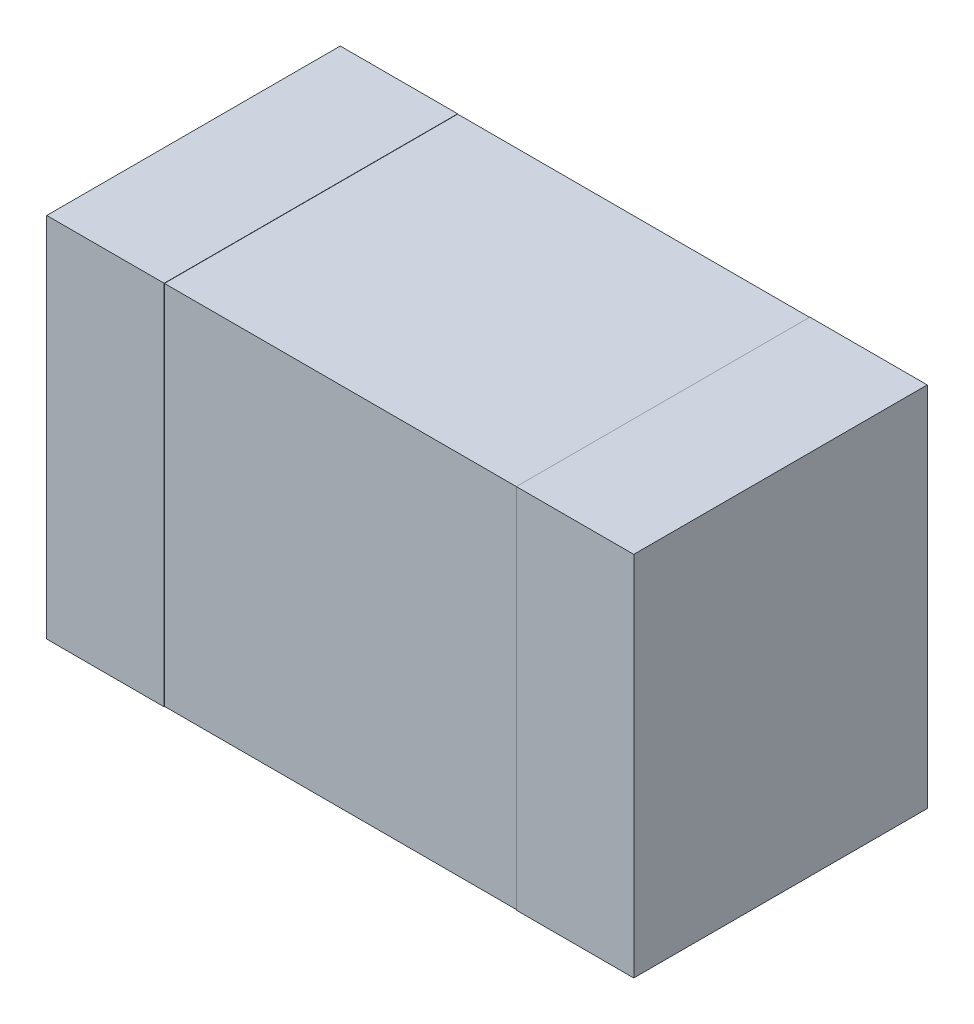
ISO-10303-21;
HEADER;
FILE_DESCRIPTION(('STEP AP214'),'2;1');
FILE_NAME('part.step','',(''),(''),'','','');
FILE_SCHEMA(('AUTOMOTIVE_DESIGN { 1 0 10303 214 1 1 1 1 }'));
ENDSEC;
DATA;
#1=APPLICATION_CONTEXT('core data for automotive mechanical design processes');
#2=APPLICATION_PROTOCOL_DEFINITION('international standard','automotive_design',2000,#1);
#3=PRODUCT_CONTEXT('',#1,'mechanical');
#4=PRODUCT('Part','Part','',(#3));
#5=PRODUCT_RELATED_PRODUCT_CATEGORY('part','',(#4));
#6=PRODUCT_DEFINITION_FORMATION('','',#4);
#7=PRODUCT_DEFINITION_CONTEXT('part definition',#1,'design');
#8=PRODUCT_DEFINITION('design','',#6,#7);
#9=PRODUCT_DEFINITION_SHAPE('','',#8);
#10=(LENGTH_UNIT() NAMED_UNIT(*) SI_UNIT(.MILLI.,.METRE.));
#11=(NAMED_UNIT(*) PLANE_ANGLE_UNIT() SI_UNIT($,.RADIAN.));
#12=(NAMED_UNIT(*) SI_UNIT($,.STERADIAN.) SOLID_ANGLE_UNIT());
#13=UNCERTAINTY_MEASURE_WITH_UNIT(LENGTH_MEASURE(1.E-05),#10,'distance_accuracy_value','');
#14=(GEOMETRIC_REPRESENTATION_CONTEXT(3) GLOBAL_UNCERTAINTY_ASSIGNED_CONTEXT((#13)) GLOBAL_UNIT_ASSIGNED_CONTEXT((#10,
#11,#12)) REPRESENTATION_CONTEXT('',''));
#15=CARTESIAN_POINT('',(0.,0.,0.));
#16=DIRECTION('',(0.,0.,1.));
#17=DIRECTION('',(1.,0.,0.));
#18=AXIS2_PLACEMENT_3D('',#15,#16,#17);
#19=CARTESIAN_POINT('',(0.,0.,1.));
#20=DIRECTION('',(0.,0.,1.));
#21=DIRECTION('',(1.,0.,0.));
#22=AXIS2_PLACEMENT_3D('',#19,#20,#21);
#23=PLANE('',#22);
#24=DIRECTION('',(0.,1.,0.));
#25=VECTOR('',#24,1.);
#26=CARTESIAN_POINT('',(1.,0.625,1.));
#27=LINE('',#26,#25);
#28=CARTESIAN_POINT('',(1.,-0.625,1.));
#29=VERTEX_POINT('',#28);
#30=CARTESIAN_POINT('',(1.,0.625,1.));
#31=VERTEX_POINT('',#30);
#32=EDGE_CURVE('E223',#29,#31,#27,.T.);
#33=ORIENTED_EDGE('',*,*,#32,.T.);
#34=DIRECTION('',(1.,0.,0.));
#35=VECTOR('',#34,1.);
#36=CARTESIAN_POINT('',(-1.,0.625,1.));
#37=LINE('',#36,#35);
#38=CARTESIAN_POINT('',(0.6,0.625,1.));
#39=VERTEX_POINT('',#38);
#40=EDGE_CURVE('E217',#31,#39,#37,.F.);
#41=ORIENTED_EDGE('',*,*,#40,.T.);
#42=DIRECTION('',(0.,1.,0.));
#43=VECTOR('',#42,1.);
#44=CARTESIAN_POINT('',(0.6,0.625,1.));
#45=LINE('',#44,#43);
#46=CARTESIAN_POINT('',(0.6,-0.625,1.));
#47=VERTEX_POINT('',#46);
#48=EDGE_CURVE('E211',#39,#47,#45,.F.);
#49=ORIENTED_EDGE('',*,*,#48,.T.);
#50=DIRECTION('',(1.,0.,0.));
#51=VECTOR('',#50,1.);
#52=CARTESIAN_POINT('',(-1.,-0.625,1.));
#53=LINE('',#52,#51);
#54=EDGE_CURVE('E93',#47,#29,#53,.T.);
#55=ORIENTED_EDGE('',*,*,#54,.T.);
#56=EDGE_LOOP('',(#33,#41,#49,#55));
#57=FACE_BOUND('',#56,.T.);
#58=ADVANCED_FACE('F16',(#57),#23,.T.);
#59=CARTESIAN_POINT('',(0.,0.,1.));
#60=DIRECTION('',(0.,0.,1.));
#61=DIRECTION('',(1.,0.,0.));
#62=AXIS2_PLACEMENT_3D('',#59,#60,#61);
#63=PLANE('',#62);
#64=DIRECTION('',(1.,0.,0.));
#65=VECTOR('',#64,1.);
#66=CARTESIAN_POINT('',(-1.,0.625,1.));
#67=LINE('',#66,#65);
#68=CARTESIAN_POINT('',(-0.6,0.625,1.));
#69=VERTEX_POINT('',#68);
#70=CARTESIAN_POINT('',(-1.,0.625,1.));
#71=VERTEX_POINT('',#70);
#72=EDGE_CURVE('E107',#69,#71,#67,.F.);
#73=ORIENTED_EDGE('',*,*,#72,.T.);
#74=DIRECTION('',(0.,1.,0.));
#75=VECTOR('',#74,1.);
#76=CARTESIAN_POINT('',(-1.,0.625,1.));
#77=LINE('',#76,#75);
#78=CARTESIAN_POINT('',(-1.,-0.625,1.));
#79=VERTEX_POINT('',#78);
#80=EDGE_CURVE('E136',#71,#79,#77,.F.);
#81=ORIENTED_EDGE('',*,*,#80,.T.);
#82=DIRECTION('',(1.,0.,0.));
#83=VECTOR('',#82,1.);
#84=CARTESIAN_POINT('',(-1.,-0.625,1.));
#85=LINE('',#84,#83);
#86=CARTESIAN_POINT('',(-0.6,-0.625,1.));
#87=VERTEX_POINT('',#86);
#88=EDGE_CURVE('E119',#79,#87,#85,.T.);
#89=ORIENTED_EDGE('',*,*,#88,.T.);
#90=DIRECTION('',(0.,1.,0.));
#91=VECTOR('',#90,1.);
#92=CARTESIAN_POINT('',(-0.6,0.625,1.));
#93=LINE('',#92,#91);
#94=EDGE_CURVE('E184',#87,#69,#93,.T.);
#95=ORIENTED_EDGE('',*,*,#94,.T.);
#96=EDGE_LOOP('',(#73,#81,#89,#95));
#97=FACE_BOUND('',#96,.T.);
#98=ADVANCED_FACE('F288',(#97),#63,.T.);
#99=CARTESIAN_POINT('',(0.6,-0.625,0.999));
#100=DIRECTION('',(0.,0.,-1.));
#101=DIRECTION('',(-1.,0.,0.));
#102=AXIS2_PLACEMENT_3D('',#99,#100,#101);
#103=PLANE('',#102);
#104=DIRECTION('',(1.,0.,0.));
#105=VECTOR('',#104,1.);
#106=CARTESIAN_POINT('',(0.6,0.624,0.999));
#107=LINE('',#106,#105);
#108=CARTESIAN_POINT('',(0.6,0.624,0.999));
#109=VERTEX_POINT('',#108);
#110=CARTESIAN_POINT('',(-0.6,0.624,0.999));
#111=VERTEX_POINT('',#110);
#112=EDGE_CURVE('E114',#109,#111,#107,.F.);
#113=ORIENTED_EDGE('',*,*,#112,.T.);
#114=DIRECTION('',(0.,1.,0.));
#115=VECTOR('',#114,1.);
#116=CARTESIAN_POINT('',(-0.6,0.625,0.999));
#117=LINE('',#116,#115);
#118=CARTESIAN_POINT('',(-0.6,-0.624,0.999));
#119=VERTEX_POINT('',#118);
#120=EDGE_CURVE('E190',#111,#119,#117,.F.);
#121=ORIENTED_EDGE('',*,*,#120,.T.);
#122=DIRECTION('',(1.,0.,0.));
#123=VECTOR('',#122,1.);
#124=CARTESIAN_POINT('',(0.6,-0.624,0.999));
#125=LINE('',#124,#123);
#126=CARTESIAN_POINT('',(0.6,-0.624,0.999));
#127=VERTEX_POINT('',#126);
#128=EDGE_CURVE('E176',#119,#127,#125,.T.);
#129=ORIENTED_EDGE('',*,*,#128,.T.);
#130=DIRECTION('',(0.,1.,0.));
#131=VECTOR('',#130,1.);
#132=CARTESIAN_POINT('',(0.6,0.625,0.999));
#133=LINE('',#132,#131);
#134=EDGE_CURVE('E68',#127,#109,#133,.T.);
#135=ORIENTED_EDGE('',*,*,#134,.T.);
#136=EDGE_LOOP('',(#113,#121,#129,#135));
#137=FACE_BOUND('',#136,.T.);
#138=ADVANCED_FACE('F293',(#137),#103,.F.);
#139=CARTESIAN_POINT('',(-1.,-0.625,1.));
#140=DIRECTION('',(0.,1.,0.));
#141=DIRECTION('',(0.,0.,1.));
#142=AXIS2_PLACEMENT_3D('',#139,#140,#141);
#143=PLANE('',#142);
#144=DIRECTION('',(0.,0.,-1.));
#145=VECTOR('',#144,1.);
#146=CARTESIAN_POINT('',(0.6,-0.625,1.));
#147=LINE('',#146,#145);
#148=CARTESIAN_POINT('',(0.6,-0.625,0.));
#149=VERTEX_POINT('',#148);
#150=EDGE_CURVE('E209',#47,#149,#147,.T.);
#151=ORIENTED_EDGE('',*,*,#150,.T.);
#152=DIRECTION('',(1.,0.,0.));
#153=VECTOR('',#152,1.);
#154=CARTESIAN_POINT('',(0.,-0.625,0.));
#155=LINE('',#154,#153);
#156=CARTESIAN_POINT('',(1.,-0.625,0.));
#157=VERTEX_POINT('',#156);
#158=EDGE_CURVE('E170',#149,#157,#155,.T.);
#159=ORIENTED_EDGE('',*,*,#158,.T.);
#160=DIRECTION('',(0.,0.,1.));
#161=VECTOR('',#160,1.);
#162=CARTESIAN_POINT('',(1.,-0.625,1.));
#163=LINE('',#162,#161);
#164=EDGE_CURVE('E230',#157,#29,#163,.T.);
#165=ORIENTED_EDGE('',*,*,#164,.T.);
#166=ORIENTED_EDGE('',*,*,#54,.F.);
#167=EDGE_LOOP('',(#151,#159,#165,#166));
#168=FACE_BOUND('',#167,.T.);
#169=ADVANCED_FACE('F285',(#168),#143,.F.);
#170=CARTESIAN_POINT('',(1.,0.625,1.));
#171=DIRECTION('',(-1.,0.,0.));
#172=DIRECTION('',(0.,0.,1.));
#173=AXIS2_PLACEMENT_3D('',#170,#171,#172);
#174=PLANE('',#173);
#175=DIRECTION('',(0.,0.,-1.));
#176=VECTOR('',#175,1.);
#177=CARTESIAN_POINT('',(1.,0.625,1.));
#178=LINE('',#177,#176);
#179=CARTESIAN_POINT('',(1.,0.625,0.));
#180=VERTEX_POINT('',#179);
#181=EDGE_CURVE('E220',#180,#31,#178,.F.);
#182=ORIENTED_EDGE('',*,*,#181,.T.);
#183=ORIENTED_EDGE('',*,*,#32,.F.);
#184=ORIENTED_EDGE('',*,*,#164,.F.);
#185=DIRECTION('',(0.,1.,0.));
#186=VECTOR('',#185,1.);
#187=CARTESIAN_POINT('',(1.,0.,0.));
#188=LINE('',#187,#186);
#189=EDGE_CURVE('E167',#157,#180,#188,.T.);
#190=ORIENTED_EDGE('',*,*,#189,.T.);
#191=EDGE_LOOP('',(#182,#183,#184,#190));
#192=FACE_BOUND('',#191,.T.);
#193=ADVANCED_FACE('F284',(#192),#174,.F.);
#194=CARTESIAN_POINT('',(-1.,0.625,1.));
#195=DIRECTION('',(0.,-1.,0.));
#196=DIRECTION('',(0.,0.,-1.));
#197=AXIS2_PLACEMENT_3D('',#194,#195,#196);
#198=PLANE('',#197);
#199=DIRECTION('',(0.,0.,-1.));
#200=VECTOR('',#199,1.);
#201=CARTESIAN_POINT('',(0.6,0.625,1.));
#202=LINE('',#201,#200);
#203=CARTESIAN_POINT('',(0.6,0.625,0.));
#204=VERTEX_POINT('',#203);
#205=EDGE_CURVE('E214',#204,#39,#202,.F.);
#206=ORIENTED_EDGE('',*,*,#205,.T.);
#207=ORIENTED_EDGE('',*,*,#40,.F.);
#208=ORIENTED_EDGE('',*,*,#181,.F.);
#209=DIRECTION('',(1.,0.,0.));
#210=VECTOR('',#209,1.);
#211=CARTESIAN_POINT('',(0.,0.625,0.));
#212=LINE('',#211,#210);
#213=EDGE_CURVE('E164',#180,#204,#212,.F.);
#214=ORIENTED_EDGE('',*,*,#213,.T.);
#215=EDGE_LOOP('',(#206,#207,#208,#214));
#216=FACE_BOUND('',#215,.T.);
#217=ADVANCED_FACE('F280',(#216),#198,.F.);
#218=CARTESIAN_POINT('',(0.6,0.625,1.));
#219=DIRECTION('',(1.,0.,0.));
#220=DIRECTION('',(0.,0.,-1.));
#221=AXIS2_PLACEMENT_3D('',#218,#219,#220);
#222=PLANE('',#221);
#223=DIRECTION('',(0.,0.,-1.));
#224=VECTOR('',#223,1.);
#225=CARTESIAN_POINT('',(0.6,0.624,1.));
#226=LINE('',#225,#224);
#227=CARTESIAN_POINT('',(0.6,0.624,0.));
#228=VERTEX_POINT('',#227);
#229=EDGE_CURVE('E205',#228,#109,#226,.F.);
#230=ORIENTED_EDGE('',*,*,#229,.T.);
#231=ORIENTED_EDGE('',*,*,#134,.F.);
#232=DIRECTION('',(0.,0.,1.));
#233=VECTOR('',#232,1.);
#234=CARTESIAN_POINT('',(0.6,-0.624,1.));
#235=LINE('',#234,#233);
#236=CARTESIAN_POINT('',(0.6,-0.624,0.));
#237=VERTEX_POINT('',#236);
#238=EDGE_CURVE('E179',#127,#237,#235,.F.);
#239=ORIENTED_EDGE('',*,*,#238,.T.);
#240=DIRECTION('',(0.,1.,0.));
#241=VECTOR('',#240,1.);
#242=CARTESIAN_POINT('',(0.6,0.625,0.));
#243=LINE('',#242,#241);
#244=EDGE_CURVE('E19',#237,#149,#243,.F.);
#245=ORIENTED_EDGE('',*,*,#244,.T.);
#246=ORIENTED_EDGE('',*,*,#150,.F.);
#247=ORIENTED_EDGE('',*,*,#48,.F.);
#248=ORIENTED_EDGE('',*,*,#205,.F.);
#249=DIRECTION('',(0.,1.,0.));
#250=VECTOR('',#249,1.);
#251=CARTESIAN_POINT('',(0.6,0.625,0.));
#252=LINE('',#251,#250);
#253=EDGE_CURVE('E163',#204,#228,#252,.F.);
#254=ORIENTED_EDGE('',*,*,#253,.T.);
#255=EDGE_LOOP('',(#230,#231,#239,#245,#246,#247,#248,#254));
#256=FACE_BOUND('',#255,.T.);
#257=ADVANCED_FACE('F274',(#256),#222,.F.);
#258=CARTESIAN_POINT('',(0.6,0.624,1.));
#259=DIRECTION('',(0.,-1.,0.));
#260=DIRECTION('',(0.,0.,-1.));
#261=AXIS2_PLACEMENT_3D('',#258,#259,#260);
#262=PLANE('',#261);
#263=ORIENTED_EDGE('',*,*,#112,.F.);
#264=ORIENTED_EDGE('',*,*,#229,.F.);
#265=DIRECTION('',(1.,0.,0.));
#266=VECTOR('',#265,1.);
#267=CARTESIAN_POINT('',(0.,0.624,0.));
#268=LINE('',#267,#266);
#269=CARTESIAN_POINT('',(-0.6,0.624,0.));
#270=VERTEX_POINT('',#269);
#271=EDGE_CURVE('E153',#228,#270,#268,.F.);
#272=ORIENTED_EDGE('',*,*,#271,.T.);
#273=DIRECTION('',(0.,0.,1.));
#274=VECTOR('',#273,1.);
#275=CARTESIAN_POINT('',(-0.6,0.624,1.));
#276=LINE('',#275,#274);
#277=EDGE_CURVE('E193',#270,#111,#276,.T.);
#278=ORIENTED_EDGE('',*,*,#277,.T.);
#279=EDGE_LOOP('',(#263,#264,#272,#278));
#280=FACE_BOUND('',#279,.T.);
#281=ADVANCED_FACE('F313',(#280),#262,.F.);
#282=CARTESIAN_POINT('',(-1.,0.625,1.));
#283=DIRECTION('',(0.,-1.,0.));
#284=DIRECTION('',(0.,0.,-1.));
#285=AXIS2_PLACEMENT_3D('',#282,#283,#284);
#286=PLANE('',#285);
#287=DIRECTION('',(0.,0.,1.));
#288=VECTOR('',#287,1.);
#289=CARTESIAN_POINT('',(-0.6,0.625,1.));
#290=LINE('',#289,#288);
#291=CARTESIAN_POINT('',(-0.6,0.625,0.));
#292=VERTEX_POINT('',#291);
#293=EDGE_CURVE('E150',#69,#292,#290,.F.);
#294=ORIENTED_EDGE('',*,*,#293,.T.);
#295=DIRECTION('',(1.,0.,0.));
#296=VECTOR('',#295,1.);
#297=CARTESIAN_POINT('',(0.,0.625,0.));
#298=LINE('',#297,#296);
#299=CARTESIAN_POINT('',(-1.,0.625,0.));
#300=VERTEX_POINT('',#299);
#301=EDGE_CURVE('E144',#292,#300,#298,.F.);
#302=ORIENTED_EDGE('',*,*,#301,.T.);
#303=DIRECTION('',(0.,0.,-1.));
#304=VECTOR('',#303,1.);
#305=CARTESIAN_POINT('',(-1.,0.625,1.));
#306=LINE('',#305,#304);
#307=EDGE_CURVE('E132',#300,#71,#306,.F.);
#308=ORIENTED_EDGE('',*,*,#307,.T.);
#309=ORIENTED_EDGE('',*,*,#72,.F.);
#310=EDGE_LOOP('',(#294,#302,#308,#309));
#311=FACE_BOUND('',#310,.T.);
#312=ADVANCED_FACE('F148',(#311),#286,.F.);
#313=CARTESIAN_POINT('',(-1.,0.625,1.));
#314=DIRECTION('',(1.,0.,0.));
#315=DIRECTION('',(0.,0.,-1.));
#316=AXIS2_PLACEMENT_3D('',#313,#314,#315);
#317=PLANE('',#316);
#318=DIRECTION('',(0.,0.,1.));
#319=VECTOR('',#318,1.);
#320=CARTESIAN_POINT('',(-1.,-0.625,1.));
#321=LINE('',#320,#319);
#322=CARTESIAN_POINT('',(-1.,-0.625,0.));
#323=VERTEX_POINT('',#322);
#324=EDGE_CURVE('E126',#323,#79,#321,.T.);
#325=ORIENTED_EDGE('',*,*,#324,.T.);
#326=ORIENTED_EDGE('',*,*,#80,.F.);
#327=ORIENTED_EDGE('',*,*,#307,.F.);
#328=DIRECTION('',(0.,1.,0.));
#329=VECTOR('',#328,1.);
#330=CARTESIAN_POINT('',(-1.,0.,0.));
#331=LINE('',#330,#329);
#332=EDGE_CURVE('E135',#300,#323,#331,.F.);
#333=ORIENTED_EDGE('',*,*,#332,.T.);
#334=EDGE_LOOP('',(#325,#326,#327,#333));
#335=FACE_BOUND('',#334,.T.);
#336=ADVANCED_FACE('F134',(#335),#317,.F.);
#337=CARTESIAN_POINT('',(-1.,-0.625,1.));
#338=DIRECTION('',(0.,1.,0.));
#339=DIRECTION('',(0.,0.,1.));
#340=AXIS2_PLACEMENT_3D('',#337,#338,#339);
#341=PLANE('',#340);
#342=DIRECTION('',(0.,0.,1.));
#343=VECTOR('',#342,1.);
#344=CARTESIAN_POINT('',(-0.6,-0.625,1.));
#345=LINE('',#344,#343);
#346=CARTESIAN_POINT('',(-0.6,-0.625,0.));
#347=VERTEX_POINT('',#346);
#348=EDGE_CURVE('E187',#347,#87,#345,.T.);
#349=ORIENTED_EDGE('',*,*,#348,.T.);
#350=ORIENTED_EDGE('',*,*,#88,.F.);
#351=ORIENTED_EDGE('',*,*,#324,.F.);
#352=DIRECTION('',(1.,0.,0.));
#353=VECTOR('',#352,1.);
#354=CARTESIAN_POINT('',(0.,-0.625,0.));
#355=LINE('',#354,#353);
#356=EDGE_CURVE('E146',#323,#347,#355,.T.);
#357=ORIENTED_EDGE('',*,*,#356,.T.);
#358=EDGE_LOOP('',(#349,#350,#351,#357));
#359=FACE_BOUND('',#358,.T.);
#360=ADVANCED_FACE('F305',(#359),#341,.F.);
#361=CARTESIAN_POINT('',(-0.6,0.625,1.));
#362=DIRECTION('',(-1.,0.,0.));
#363=DIRECTION('',(0.,0.,1.));
#364=AXIS2_PLACEMENT_3D('',#361,#362,#363);
#365=PLANE('',#364);
#366=ORIENTED_EDGE('',*,*,#293,.F.);
#367=ORIENTED_EDGE('',*,*,#94,.F.);
#368=ORIENTED_EDGE('',*,*,#348,.F.);
#369=DIRECTION('',(0.,1.,0.));
#370=VECTOR('',#369,1.);
#371=CARTESIAN_POINT('',(-0.6,0.625,0.));
#372=LINE('',#371,#370);
#373=CARTESIAN_POINT('',(-0.6,-0.624,0.));
#374=VERTEX_POINT('',#373);
#375=EDGE_CURVE('E25',#347,#374,#372,.T.);
#376=ORIENTED_EDGE('',*,*,#375,.T.);
#377=DIRECTION('',(0.,0.,1.));
#378=VECTOR('',#377,1.);
#379=CARTESIAN_POINT('',(-0.6,-0.624,1.));
#380=LINE('',#379,#378);
#381=EDGE_CURVE('E33',#374,#119,#380,.T.);
#382=ORIENTED_EDGE('',*,*,#381,.T.);
#383=ORIENTED_EDGE('',*,*,#120,.F.);
#384=ORIENTED_EDGE('',*,*,#277,.F.);
#385=DIRECTION('',(0.,1.,0.));
#386=VECTOR('',#385,1.);
#387=CARTESIAN_POINT('',(-0.6,0.625,0.));
#388=LINE('',#387,#386);
#389=EDGE_CURVE('E151',#270,#292,#388,.T.);
#390=ORIENTED_EDGE('',*,*,#389,.T.);
#391=EDGE_LOOP('',(#366,#367,#368,#376,#382,#383,#384,#390));
#392=FACE_BOUND('',#391,.T.);
#393=ADVANCED_FACE('F300',(#392),#365,.F.);
#394=CARTESIAN_POINT('',(0.6,-0.624,1.));
#395=DIRECTION('',(0.,1.,0.));
#396=DIRECTION('',(0.,0.,1.));
#397=AXIS2_PLACEMENT_3D('',#394,#395,#396);
#398=PLANE('',#397);
#399=ORIENTED_EDGE('',*,*,#128,.F.);
#400=ORIENTED_EDGE('',*,*,#381,.F.);
#401=DIRECTION('',(1.,0.,0.));
#402=VECTOR('',#401,1.);
#403=CARTESIAN_POINT('',(0.,-0.624,0.));
#404=LINE('',#403,#402);
#405=EDGE_CURVE('E11',#374,#237,#404,.T.);
#406=ORIENTED_EDGE('',*,*,#405,.T.);
#407=ORIENTED_EDGE('',*,*,#238,.F.);
#408=EDGE_LOOP('',(#399,#400,#406,#407));
#409=FACE_BOUND('',#408,.T.);
#410=ADVANCED_FACE('F295',(#409),#398,.F.);
#411=CARTESIAN_POINT('',(0.,0.,0.));
#412=DIRECTION('',(0.,0.,1.));
#413=DIRECTION('',(1.,0.,0.));
#414=AXIS2_PLACEMENT_3D('',#411,#412,#413);
#415=PLANE('',#414);
#416=ORIENTED_EDGE('',*,*,#375,.F.);
#417=ORIENTED_EDGE('',*,*,#356,.F.);
#418=ORIENTED_EDGE('',*,*,#332,.F.);
#419=ORIENTED_EDGE('',*,*,#301,.F.);
#420=ORIENTED_EDGE('',*,*,#389,.F.);
#421=ORIENTED_EDGE('',*,*,#271,.F.);
#422=ORIENTED_EDGE('',*,*,#253,.F.);
#423=ORIENTED_EDGE('',*,*,#213,.F.);
#424=ORIENTED_EDGE('',*,*,#189,.F.);
#425=ORIENTED_EDGE('',*,*,#158,.F.);
#426=ORIENTED_EDGE('',*,*,#244,.F.);
#427=ORIENTED_EDGE('',*,*,#405,.F.);
#428=EDGE_LOOP('',(#416,#417,#418,#419,#420,#421,#422,#423,#424,#425,#426,#427));
#429=FACE_BOUND('',#428,.T.);
#430=ADVANCED_FACE('F142',(#429),#415,.F.);
#431=CLOSED_SHELL('',(#58,#98,#138,#169,#193,#217,#257,#281,#312,#336,#360,#393,#410,#430));
#432=MANIFOLD_SOLID_BREP('B1',#431);
#433=ADVANCED_BREP_SHAPE_REPRESENTATION('',(#18,#432),#14);
#434=SHAPE_DEFINITION_REPRESENTATION(#9,#433);
ENDSEC;
END-ISO-10303-21;
